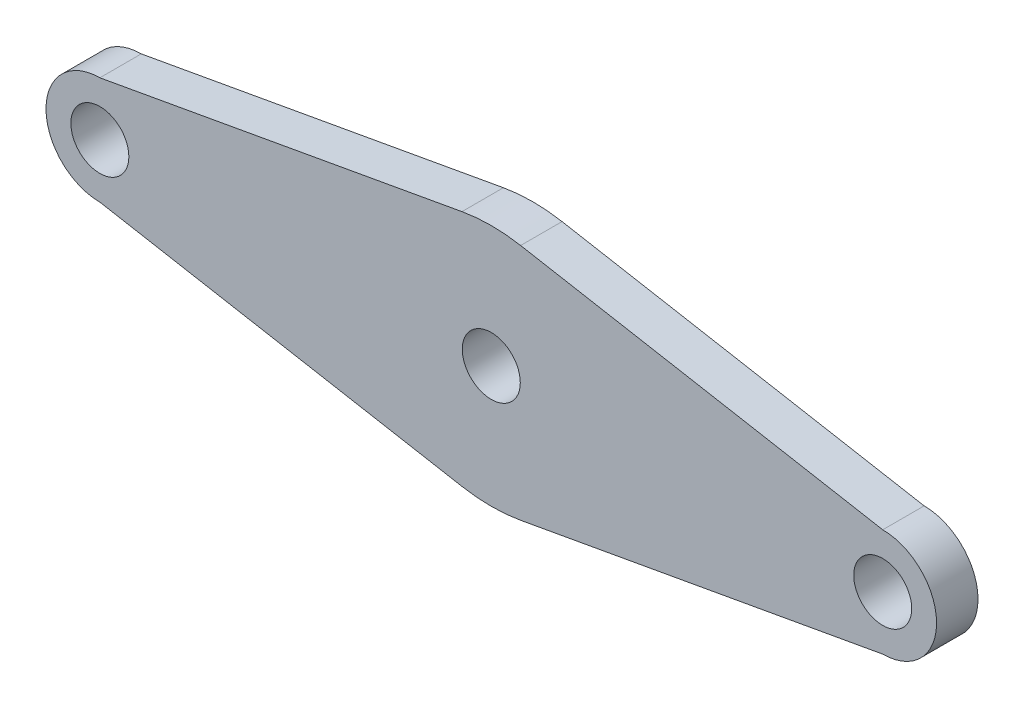
ISO-10303-21;
HEADER;
FILE_DESCRIPTION(('STEP AP214'),'2;1');
FILE_NAME('part.step','',(''),(''),'','','');
FILE_SCHEMA(('AUTOMOTIVE_DESIGN { 1 0 10303 214 1 1 1 1 }'));
ENDSEC;
DATA;
#1=APPLICATION_CONTEXT('core data for automotive mechanical design processes');
#2=APPLICATION_PROTOCOL_DEFINITION('international standard','automotive_design',2000,#1);
#3=PRODUCT_CONTEXT('',#1,'mechanical');
#4=PRODUCT('Part','Part','',(#3));
#5=PRODUCT_RELATED_PRODUCT_CATEGORY('part','',(#4));
#6=PRODUCT_DEFINITION_FORMATION('','',#4);
#7=PRODUCT_DEFINITION_CONTEXT('part definition',#1,'design');
#8=PRODUCT_DEFINITION('design','',#6,#7);
#9=PRODUCT_DEFINITION_SHAPE('','',#8);
#10=(LENGTH_UNIT() NAMED_UNIT(*) SI_UNIT(.MILLI.,.METRE.));
#11=(NAMED_UNIT(*) PLANE_ANGLE_UNIT() SI_UNIT($,.RADIAN.));
#12=(NAMED_UNIT(*) SI_UNIT($,.STERADIAN.) SOLID_ANGLE_UNIT());
#13=UNCERTAINTY_MEASURE_WITH_UNIT(LENGTH_MEASURE(1.E-05),#10,'distance_accuracy_value','');
#14=(GEOMETRIC_REPRESENTATION_CONTEXT(3) GLOBAL_UNCERTAINTY_ASSIGNED_CONTEXT((#13)) GLOBAL_UNIT_ASSIGNED_CONTEXT((#10,
#11,#12)) REPRESENTATION_CONTEXT('',''));
#15=CARTESIAN_POINT('',(0.,0.,0.));
#16=DIRECTION('',(0.,0.,1.));
#17=DIRECTION('',(1.,0.,0.));
#18=AXIS2_PLACEMENT_3D('',#15,#16,#17);
#19=CARTESIAN_POINT('',(1.30691216747566,-7.26489410743824,2.5));
#20=DIRECTION('',(-0.177052117585664,0.984201477167369,0.));
#21=DIRECTION('',(-0.984201477167369,-0.177052117585664,0.));
#22=AXIS2_PLACEMENT_3D('',#19,#20,#21);
#23=PLANE('',#22);
#24=DIRECTION('',(0.98420147716737,0.177052117585664,0.));
#25=VECTOR('',#24,1.);
#26=CARTESIAN_POINT('',(1.30691216747566,-7.26489410743824,2.5));
#27=LINE('',#26,#25);
#28=CARTESIAN_POINT('',(1.77052117585665,-7.18149354508399,2.5));
#29=VERTEX_POINT('',#28);
#30=CARTESIAN_POINT('',(23.625,-3.25,2.5));
#31=VERTEX_POINT('',#30);
#32=EDGE_CURVE('E129',#29,#31,#27,.T.);
#33=ORIENTED_EDGE('',*,*,#32,.F.);
#34=DIRECTION('',(0.,0.,-1.));
#35=VECTOR('',#34,1.);
#36=CARTESIAN_POINT('',(1.77052117585665,-7.18149354508399,2.5));
#37=LINE('',#36,#35);
#38=CARTESIAN_POINT('',(1.77052117585665,-7.18149354508399,0.));
#39=VERTEX_POINT('',#38);
#40=EDGE_CURVE('E159',#29,#39,#37,.T.);
#41=ORIENTED_EDGE('',*,*,#40,.T.);
#42=DIRECTION('',(0.98420147716737,0.177052117585664,0.));
#43=VECTOR('',#42,1.);
#44=CARTESIAN_POINT('',(1.30691216747566,-7.26489410743824,0.));
#45=LINE('',#44,#43);
#46=CARTESIAN_POINT('',(23.625,-3.25,0.));
#47=VERTEX_POINT('',#46);
#48=EDGE_CURVE('E156',#39,#47,#45,.T.);
#49=ORIENTED_EDGE('',*,*,#48,.T.);
#50=DIRECTION('',(0.,0.,-1.));
#51=VECTOR('',#50,1.);
#52=CARTESIAN_POINT('',(23.625,-3.25,2.5));
#53=LINE('',#52,#51);
#54=EDGE_CURVE('E149',#31,#47,#53,.T.);
#55=ORIENTED_EDGE('',*,*,#54,.F.);
#56=EDGE_LOOP('',(#33,#41,#49,#55));
#57=FACE_BOUND('',#56,.T.);
#58=ADVANCED_FACE('F49',(#57),#23,.F.);
#59=CARTESIAN_POINT('',(23.625,0.,2.5));
#60=DIRECTION('',(0.,0.,-1.));
#61=DIRECTION('',(-1.,0.,0.));
#62=AXIS2_PLACEMENT_3D('',#59,#60,#61);
#63=CYLINDRICAL_SURFACE('',#62,3.25);
#64=CARTESIAN_POINT('',(23.625,0.,0.));
#65=DIRECTION('',(0.,0.,1.));
#66=DIRECTION('',(1.,0.,0.));
#67=AXIS2_PLACEMENT_3D('',#64,#65,#66);
#68=CIRCLE('',#67,3.25);
#69=CARTESIAN_POINT('',(23.625,3.25,0.));
#70=VERTEX_POINT('',#69);
#71=EDGE_CURVE('E204',#47,#70,#68,.T.);
#72=ORIENTED_EDGE('',*,*,#71,.T.);
#73=DIRECTION('',(0.,0.,-1.));
#74=VECTOR('',#73,1.);
#75=CARTESIAN_POINT('',(23.625,3.25,2.5));
#76=LINE('',#75,#74);
#77=CARTESIAN_POINT('',(23.625,3.25,2.5));
#78=VERTEX_POINT('',#77);
#79=EDGE_CURVE('E151',#78,#70,#76,.T.);
#80=ORIENTED_EDGE('',*,*,#79,.F.);
#81=CARTESIAN_POINT('',(23.625,0.,2.5));
#82=DIRECTION('',(0.,0.,1.));
#83=DIRECTION('',(1.,0.,0.));
#84=AXIS2_PLACEMENT_3D('',#81,#82,#83);
#85=CIRCLE('',#84,3.25);
#86=EDGE_CURVE('E134',#31,#78,#85,.T.);
#87=ORIENTED_EDGE('',*,*,#86,.F.);
#88=ORIENTED_EDGE('',*,*,#54,.T.);
#89=EDGE_LOOP('',(#72,#80,#87,#88));
#90=FACE_BOUND('',#89,.T.);
#91=ADVANCED_FACE('F148',(#90),#63,.T.);
#92=CARTESIAN_POINT('',(1.30691216747566,7.26489410743824,2.5));
#93=DIRECTION('',(0.177052117585664,0.984201477167369,0.));
#94=DIRECTION('',(-0.984201477167369,0.177052117585664,0.));
#95=AXIS2_PLACEMENT_3D('',#92,#93,#94);
#96=PLANE('',#95);
#97=DIRECTION('',(0.98420147716737,-0.177052117585664,0.));
#98=VECTOR('',#97,1.);
#99=CARTESIAN_POINT('',(1.30691216747566,7.26489410743824,0.));
#100=LINE('',#99,#98);
#101=CARTESIAN_POINT('',(1.77052117585665,7.18149354508399,0.));
#102=VERTEX_POINT('',#101);
#103=EDGE_CURVE('E198',#102,#70,#100,.T.);
#104=ORIENTED_EDGE('',*,*,#103,.F.);
#105=DIRECTION('',(0.,0.,-1.));
#106=VECTOR('',#105,1.);
#107=CARTESIAN_POINT('',(1.77052117585665,7.18149354508399,2.5));
#108=LINE('',#107,#106);
#109=CARTESIAN_POINT('',(1.77052117585665,7.18149354508399,2.5));
#110=VERTEX_POINT('',#109);
#111=EDGE_CURVE('E11',#102,#110,#108,.F.);
#112=ORIENTED_EDGE('',*,*,#111,.T.);
#113=DIRECTION('',(0.98420147716737,-0.177052117585664,0.));
#114=VECTOR('',#113,1.);
#115=CARTESIAN_POINT('',(1.30691216747566,7.26489410743824,2.5));
#116=LINE('',#115,#114);
#117=EDGE_CURVE('E153',#110,#78,#116,.T.);
#118=ORIENTED_EDGE('',*,*,#117,.T.);
#119=ORIENTED_EDGE('',*,*,#79,.T.);
#120=EDGE_LOOP('',(#104,#112,#118,#119));
#121=FACE_BOUND('',#120,.T.);
#122=ADVANCED_FACE('F255',(#121),#96,.T.);
#123=CARTESIAN_POINT('',(-1.30691216747566,7.26489410743824,2.5));
#124=DIRECTION('',(0.177052117585664,-0.984201477167369,0.));
#125=DIRECTION('',(0.984201477167369,0.177052117585664,0.));
#126=AXIS2_PLACEMENT_3D('',#123,#124,#125);
#127=PLANE('',#126);
#128=DIRECTION('',(-0.98420147716737,-0.177052117585664,0.));
#129=VECTOR('',#128,1.);
#130=CARTESIAN_POINT('',(-1.30691216747566,7.26489410743824,2.5));
#131=LINE('',#130,#129);
#132=CARTESIAN_POINT('',(-1.77052117585664,7.18149354508399,2.5));
#133=VERTEX_POINT('',#132);
#134=CARTESIAN_POINT('',(-23.625,3.25,2.5));
#135=VERTEX_POINT('',#134);
#136=EDGE_CURVE('E189',#133,#135,#131,.T.);
#137=ORIENTED_EDGE('',*,*,#136,.F.);
#138=DIRECTION('',(0.,0.,-1.));
#139=VECTOR('',#138,1.);
#140=CARTESIAN_POINT('',(-1.77052117585664,7.18149354508399,0.));
#141=LINE('',#140,#139);
#142=CARTESIAN_POINT('',(-1.77052117585664,7.18149354508399,0.));
#143=VERTEX_POINT('',#142);
#144=EDGE_CURVE('E58',#133,#143,#141,.T.);
#145=ORIENTED_EDGE('',*,*,#144,.T.);
#146=DIRECTION('',(-0.98420147716737,-0.177052117585664,0.));
#147=VECTOR('',#146,1.);
#148=CARTESIAN_POINT('',(-1.30691216747566,7.26489410743824,0.));
#149=LINE('',#148,#147);
#150=CARTESIAN_POINT('',(-23.625,3.25,0.));
#151=VERTEX_POINT('',#150);
#152=EDGE_CURVE('E187',#143,#151,#149,.T.);
#153=ORIENTED_EDGE('',*,*,#152,.T.);
#154=DIRECTION('',(0.,0.,-1.));
#155=VECTOR('',#154,1.);
#156=CARTESIAN_POINT('',(-23.625,3.25,2.5));
#157=LINE('',#156,#155);
#158=EDGE_CURVE('E165',#135,#151,#157,.T.);
#159=ORIENTED_EDGE('',*,*,#158,.F.);
#160=EDGE_LOOP('',(#137,#145,#153,#159));
#161=FACE_BOUND('',#160,.T.);
#162=ADVANCED_FACE('F185',(#161),#127,.F.);
#163=CARTESIAN_POINT('',(-23.625,0.,2.5));
#164=DIRECTION('',(0.,0.,-1.));
#165=DIRECTION('',(-1.,0.,0.));
#166=AXIS2_PLACEMENT_3D('',#163,#164,#165);
#167=CYLINDRICAL_SURFACE('',#166,3.25);
#168=CARTESIAN_POINT('',(-23.625,0.,0.));
#169=DIRECTION('',(0.,0.,1.));
#170=DIRECTION('',(1.,0.,0.));
#171=AXIS2_PLACEMENT_3D('',#168,#169,#170);
#172=CIRCLE('',#171,3.25);
#173=CARTESIAN_POINT('',(-23.625,-3.25,0.));
#174=VERTEX_POINT('',#173);
#175=EDGE_CURVE('E196',#151,#174,#172,.T.);
#176=ORIENTED_EDGE('',*,*,#175,.T.);
#177=DIRECTION('',(0.,0.,-1.));
#178=VECTOR('',#177,1.);
#179=CARTESIAN_POINT('',(-23.625,-3.25,2.5));
#180=LINE('',#179,#178);
#181=CARTESIAN_POINT('',(-23.625,-3.25,2.5));
#182=VERTEX_POINT('',#181);
#183=EDGE_CURVE('E222',#182,#174,#180,.T.);
#184=ORIENTED_EDGE('',*,*,#183,.F.);
#185=CARTESIAN_POINT('',(-23.625,0.,2.5));
#186=DIRECTION('',(0.,0.,1.));
#187=DIRECTION('',(1.,0.,0.));
#188=AXIS2_PLACEMENT_3D('',#185,#186,#187);
#189=CIRCLE('',#188,3.25);
#190=EDGE_CURVE('E231',#135,#182,#189,.T.);
#191=ORIENTED_EDGE('',*,*,#190,.F.);
#192=ORIENTED_EDGE('',*,*,#158,.T.);
#193=EDGE_LOOP('',(#176,#184,#191,#192));
#194=FACE_BOUND('',#193,.T.);
#195=ADVANCED_FACE('F229',(#194),#167,.T.);
#196=CARTESIAN_POINT('',(-23.625,0.,2.5));
#197=DIRECTION('',(0.,0.,-1.));
#198=DIRECTION('',(-1.,0.,0.));
#199=AXIS2_PLACEMENT_3D('',#196,#197,#198);
#200=CYLINDRICAL_SURFACE('',#199,1.75);
#201=CARTESIAN_POINT('',(-23.625,0.,2.5));
#202=DIRECTION('',(0.,0.,1.));
#203=DIRECTION('',(1.,0.,0.));
#204=AXIS2_PLACEMENT_3D('',#201,#202,#203);
#205=CIRCLE('',#204,1.75);
#206=CARTESIAN_POINT('',(-21.875,0.,2.5));
#207=VERTEX_POINT('',#206);
#208=EDGE_CURVE('E246',#207,#207,#205,.T.);
#209=ORIENTED_EDGE('',*,*,#208,.T.);
#210=EDGE_LOOP('',(#209));
#211=FACE_BOUND('',#210,.T.);
#212=CARTESIAN_POINT('',(-23.625,0.,0.));
#213=DIRECTION('',(0.,0.,1.));
#214=DIRECTION('',(1.,0.,0.));
#215=AXIS2_PLACEMENT_3D('',#212,#213,#214);
#216=CIRCLE('',#215,1.75);
#217=CARTESIAN_POINT('',(-21.875,0.,0.));
#218=VERTEX_POINT('',#217);
#219=EDGE_CURVE('E215',#218,#218,#216,.T.);
#220=ORIENTED_EDGE('',*,*,#219,.F.);
#221=EDGE_LOOP('',(#220));
#222=FACE_BOUND('',#221,.T.);
#223=ADVANCED_FACE('F276',(#211,#222),#200,.F.);
#224=CARTESIAN_POINT('',(0.,0.,2.5));
#225=DIRECTION('',(0.,0.,-1.));
#226=DIRECTION('',(-1.,0.,0.));
#227=AXIS2_PLACEMENT_3D('',#224,#225,#226);
#228=CYLINDRICAL_SURFACE('',#227,1.75);
#229=CARTESIAN_POINT('',(0.,0.,2.5));
#230=DIRECTION('',(0.,0.,1.));
#231=DIRECTION('',(1.,0.,0.));
#232=AXIS2_PLACEMENT_3D('',#229,#230,#231);
#233=CIRCLE('',#232,1.75);
#234=CARTESIAN_POINT('',(1.75,0.,2.5));
#235=VERTEX_POINT('',#234);
#236=EDGE_CURVE('E238',#235,#235,#233,.T.);
#237=ORIENTED_EDGE('',*,*,#236,.T.);
#238=EDGE_LOOP('',(#237));
#239=FACE_BOUND('',#238,.T.);
#240=CARTESIAN_POINT('',(0.,0.,0.));
#241=DIRECTION('',(0.,0.,1.));
#242=DIRECTION('',(1.,0.,0.));
#243=AXIS2_PLACEMENT_3D('',#240,#241,#242);
#244=CIRCLE('',#243,1.75);
#245=CARTESIAN_POINT('',(1.75,0.,0.));
#246=VERTEX_POINT('',#245);
#247=EDGE_CURVE('E211',#246,#246,#244,.T.);
#248=ORIENTED_EDGE('',*,*,#247,.F.);
#249=EDGE_LOOP('',(#248));
#250=FACE_BOUND('',#249,.T.);
#251=ADVANCED_FACE('F281',(#239,#250),#228,.F.);
#252=CARTESIAN_POINT('',(-1.30691216747566,-7.26489410743824,2.5));
#253=DIRECTION('',(0.177052117585664,0.984201477167369,0.));
#254=DIRECTION('',(-0.984201477167369,0.177052117585664,0.));
#255=AXIS2_PLACEMENT_3D('',#252,#253,#254);
#256=PLANE('',#255);
#257=DIRECTION('',(0.98420147716737,-0.177052117585664,0.));
#258=VECTOR('',#257,1.);
#259=CARTESIAN_POINT('',(-1.30691216747566,-7.26489410743824,0.));
#260=LINE('',#259,#258);
#261=CARTESIAN_POINT('',(-1.77052117585664,-7.18149354508399,0.));
#262=VERTEX_POINT('',#261);
#263=EDGE_CURVE('E202',#174,#262,#260,.T.);
#264=ORIENTED_EDGE('',*,*,#263,.T.);
#265=DIRECTION('',(0.,0.,-1.));
#266=VECTOR('',#265,1.);
#267=CARTESIAN_POINT('',(-1.77052117585664,-7.18149354508399,2.5));
#268=LINE('',#267,#266);
#269=CARTESIAN_POINT('',(-1.77052117585664,-7.18149354508399,2.5));
#270=VERTEX_POINT('',#269);
#271=EDGE_CURVE('E174',#262,#270,#268,.F.);
#272=ORIENTED_EDGE('',*,*,#271,.T.);
#273=DIRECTION('',(0.98420147716737,-0.177052117585664,0.));
#274=VECTOR('',#273,1.);
#275=CARTESIAN_POINT('',(-1.30691216747566,-7.26489410743824,2.5));
#276=LINE('',#275,#274);
#277=EDGE_CURVE('E234',#182,#270,#276,.T.);
#278=ORIENTED_EDGE('',*,*,#277,.F.);
#279=ORIENTED_EDGE('',*,*,#183,.T.);
#280=EDGE_LOOP('',(#264,#272,#278,#279));
#281=FACE_BOUND('',#280,.T.);
#282=ADVANCED_FACE('F277',(#281),#256,.F.);
#283=CARTESIAN_POINT('',(23.625,0.,2.5));
#284=DIRECTION('',(0.,0.,-1.));
#285=DIRECTION('',(-1.,0.,0.));
#286=AXIS2_PLACEMENT_3D('',#283,#284,#285);
#287=CYLINDRICAL_SURFACE('',#286,1.75);
#288=CARTESIAN_POINT('',(23.625,0.,2.5));
#289=DIRECTION('',(0.,0.,1.));
#290=DIRECTION('',(1.,0.,0.));
#291=AXIS2_PLACEMENT_3D('',#288,#289,#290);
#292=CIRCLE('',#291,1.75);
#293=CARTESIAN_POINT('',(25.375,0.,2.5));
#294=VERTEX_POINT('',#293);
#295=EDGE_CURVE('E225',#294,#294,#292,.T.);
#296=ORIENTED_EDGE('',*,*,#295,.T.);
#297=EDGE_LOOP('',(#296));
#298=FACE_BOUND('',#297,.T.);
#299=CARTESIAN_POINT('',(23.625,0.,0.));
#300=DIRECTION('',(0.,0.,1.));
#301=DIRECTION('',(1.,0.,0.));
#302=AXIS2_PLACEMENT_3D('',#299,#300,#301);
#303=CIRCLE('',#302,1.75);
#304=CARTESIAN_POINT('',(25.375,0.,0.));
#305=VERTEX_POINT('',#304);
#306=EDGE_CURVE('E143',#305,#305,#303,.T.);
#307=ORIENTED_EDGE('',*,*,#306,.F.);
#308=EDGE_LOOP('',(#307));
#309=FACE_BOUND('',#308,.T.);
#310=ADVANCED_FACE('F280',(#298,#309),#287,.F.);
#311=CARTESIAN_POINT('',(0.,0.,2.5));
#312=DIRECTION('',(0.,0.,1.));
#313=DIRECTION('',(1.,0.,0.));
#314=AXIS2_PLACEMENT_3D('',#311,#312,#313);
#315=PLANE('',#314);
#316=ORIENTED_EDGE('',*,*,#277,.T.);
#317=CARTESIAN_POINT('',(0.,2.6605212265897,2.5));
#318=DIRECTION('',(0.,0.,1.));
#319=DIRECTION('',(1.,0.,0.));
#320=AXIS2_PLACEMENT_3D('',#317,#318,#319);
#321=CIRCLE('',#320,10.);
#322=EDGE_CURVE('E137',#270,#29,#321,.T.);
#323=ORIENTED_EDGE('',*,*,#322,.T.);
#324=ORIENTED_EDGE('',*,*,#32,.T.);
#325=ORIENTED_EDGE('',*,*,#86,.T.);
#326=ORIENTED_EDGE('',*,*,#117,.F.);
#327=CARTESIAN_POINT('',(0.,-2.6605212265897,2.5));
#328=DIRECTION('',(0.,0.,1.));
#329=DIRECTION('',(1.,0.,0.));
#330=AXIS2_PLACEMENT_3D('',#327,#328,#329);
#331=CIRCLE('',#330,10.);
#332=EDGE_CURVE('E68',#110,#133,#331,.T.);
#333=ORIENTED_EDGE('',*,*,#332,.T.);
#334=ORIENTED_EDGE('',*,*,#136,.T.);
#335=ORIENTED_EDGE('',*,*,#190,.T.);
#336=EDGE_LOOP('',(#316,#323,#324,#325,#326,#333,#334,#335));
#337=FACE_BOUND('',#336,.T.);
#338=ORIENTED_EDGE('',*,*,#236,.F.);
#339=EDGE_LOOP('',(#338));
#340=FACE_BOUND('',#339,.T.);
#341=ORIENTED_EDGE('',*,*,#208,.F.);
#342=EDGE_LOOP('',(#341));
#343=FACE_BOUND('',#342,.T.);
#344=ORIENTED_EDGE('',*,*,#295,.F.);
#345=EDGE_LOOP('',(#344));
#346=FACE_BOUND('',#345,.T.);
#347=ADVANCED_FACE('F132',(#337,#340,#343,#346),#315,.T.);
#348=CARTESIAN_POINT('',(0.,0.,0.));
#349=DIRECTION('',(0.,0.,1.));
#350=DIRECTION('',(1.,0.,0.));
#351=AXIS2_PLACEMENT_3D('',#348,#349,#350);
#352=PLANE('',#351);
#353=ORIENTED_EDGE('',*,*,#48,.F.);
#354=CARTESIAN_POINT('',(0.,2.6605212265897,0.));
#355=DIRECTION('',(0.,0.,1.));
#356=DIRECTION('',(1.,0.,0.));
#357=AXIS2_PLACEMENT_3D('',#354,#355,#356);
#358=CIRCLE('',#357,10.);
#359=EDGE_CURVE('E171',#39,#262,#358,.F.);
#360=ORIENTED_EDGE('',*,*,#359,.T.);
#361=ORIENTED_EDGE('',*,*,#263,.F.);
#362=ORIENTED_EDGE('',*,*,#175,.F.);
#363=ORIENTED_EDGE('',*,*,#152,.F.);
#364=CARTESIAN_POINT('',(0.,-2.6605212265897,0.));
#365=DIRECTION('',(0.,0.,1.));
#366=DIRECTION('',(1.,0.,0.));
#367=AXIS2_PLACEMENT_3D('',#364,#365,#366);
#368=CIRCLE('',#367,10.);
#369=EDGE_CURVE('E163',#143,#102,#368,.F.);
#370=ORIENTED_EDGE('',*,*,#369,.T.);
#371=ORIENTED_EDGE('',*,*,#103,.T.);
#372=ORIENTED_EDGE('',*,*,#71,.F.);
#373=EDGE_LOOP('',(#353,#360,#361,#362,#363,#370,#371,#372));
#374=FACE_BOUND('',#373,.T.);
#375=ORIENTED_EDGE('',*,*,#247,.T.);
#376=EDGE_LOOP('',(#375));
#377=FACE_BOUND('',#376,.T.);
#378=ORIENTED_EDGE('',*,*,#219,.T.);
#379=EDGE_LOOP('',(#378));
#380=FACE_BOUND('',#379,.T.);
#381=ORIENTED_EDGE('',*,*,#306,.T.);
#382=EDGE_LOOP('',(#381));
#383=FACE_BOUND('',#382,.T.);
#384=ADVANCED_FACE('F193',(#374,#377,#380,#383),#352,.F.);
#385=CARTESIAN_POINT('',(0.,2.6605212265897,2.5));
#386=DIRECTION('',(0.,0.,-1.));
#387=DIRECTION('',(-1.,0.,0.));
#388=AXIS2_PLACEMENT_3D('',#385,#386,#387);
#389=CYLINDRICAL_SURFACE('',#388,10.);
#390=ORIENTED_EDGE('',*,*,#322,.F.);
#391=ORIENTED_EDGE('',*,*,#271,.F.);
#392=ORIENTED_EDGE('',*,*,#359,.F.);
#393=ORIENTED_EDGE('',*,*,#40,.F.);
#394=EDGE_LOOP('',(#390,#391,#392,#393));
#395=FACE_BOUND('',#394,.T.);
#396=ADVANCED_FACE('F258',(#395),#389,.T.);
#397=CARTESIAN_POINT('',(0.,-2.6605212265897,2.5));
#398=DIRECTION('',(0.,0.,1.));
#399=DIRECTION('',(1.,0.,0.));
#400=AXIS2_PLACEMENT_3D('',#397,#398,#399);
#401=CYLINDRICAL_SURFACE('',#400,10.);
#402=ORIENTED_EDGE('',*,*,#332,.F.);
#403=ORIENTED_EDGE('',*,*,#111,.F.);
#404=ORIENTED_EDGE('',*,*,#369,.F.);
#405=ORIENTED_EDGE('',*,*,#144,.F.);
#406=EDGE_LOOP('',(#402,#403,#404,#405));
#407=FACE_BOUND('',#406,.T.);
#408=ADVANCED_FACE('F51',(#407),#401,.T.);
#409=CLOSED_SHELL('',(#58,#91,#122,#162,#195,#223,#251,#282,#310,#347,#384,#396,#408));
#410=MANIFOLD_SOLID_BREP('B2',#409);
#411=ADVANCED_BREP_SHAPE_REPRESENTATION('',(#18,#410),#14);
#412=SHAPE_DEFINITION_REPRESENTATION(#9,#411);
ENDSEC;
END-ISO-10303-21;
